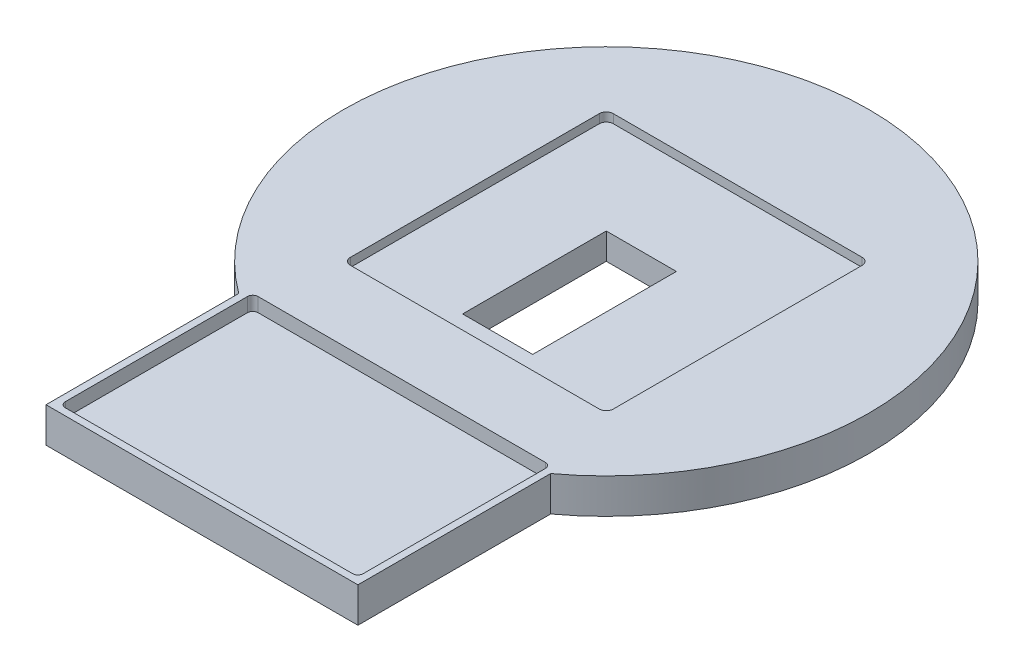
ISO-10303-21;
HEADER;
FILE_DESCRIPTION(('STEP AP214'),'2;1');
FILE_NAME('part.step','',(''),(''),'','','');
FILE_SCHEMA(('AUTOMOTIVE_DESIGN { 1 0 10303 214 1 1 1 1 }'));
ENDSEC;
DATA;
#1=APPLICATION_CONTEXT('core data for automotive mechanical design processes');
#2=APPLICATION_PROTOCOL_DEFINITION('international standard','automotive_design',2000,#1);
#3=PRODUCT_CONTEXT('',#1,'mechanical');
#4=PRODUCT('Part','Part','',(#3));
#5=PRODUCT_RELATED_PRODUCT_CATEGORY('part','',(#4));
#6=PRODUCT_DEFINITION_FORMATION('','',#4);
#7=PRODUCT_DEFINITION_CONTEXT('part definition',#1,'design');
#8=PRODUCT_DEFINITION('design','',#6,#7);
#9=PRODUCT_DEFINITION_SHAPE('','',#8);
#10=(LENGTH_UNIT() NAMED_UNIT(*) SI_UNIT(.MILLI.,.METRE.));
#11=(NAMED_UNIT(*) PLANE_ANGLE_UNIT() SI_UNIT($,.RADIAN.));
#12=(NAMED_UNIT(*) SI_UNIT($,.STERADIAN.) SOLID_ANGLE_UNIT());
#13=UNCERTAINTY_MEASURE_WITH_UNIT(LENGTH_MEASURE(1.E-05),#10,'distance_accuracy_value','');
#14=(GEOMETRIC_REPRESENTATION_CONTEXT(3) GLOBAL_UNCERTAINTY_ASSIGNED_CONTEXT((#13)) GLOBAL_UNIT_ASSIGNED_CONTEXT((#10,
#11,#12)) REPRESENTATION_CONTEXT('',''));
#15=CARTESIAN_POINT('',(0.,0.,0.));
#16=DIRECTION('',(0.,0.,1.));
#17=DIRECTION('',(1.,0.,0.));
#18=AXIS2_PLACEMENT_3D('',#15,#16,#17);
#19=CARTESIAN_POINT('',(0.,10.,0.));
#20=DIRECTION('',(0.,-1.,0.));
#21=DIRECTION('',(0.,0.,-1.));
#22=AXIS2_PLACEMENT_3D('',#19,#20,#21);
#23=CYLINDRICAL_SURFACE('',#22,75.);
#24=CARTESIAN_POINT('',(0.,0.,0.));
#25=DIRECTION('',(0.,1.,0.));
#26=DIRECTION('',(0.,0.,1.));
#27=AXIS2_PLACEMENT_3D('',#24,#25,#26);
#28=CIRCLE('',#27,75.);
#29=CARTESIAN_POINT('',(44.5,0.,60.3717649236794));
#30=VERTEX_POINT('',#29);
#31=CARTESIAN_POINT('',(-44.5,0.,60.3717649236794));
#32=VERTEX_POINT('',#31);
#33=EDGE_CURVE('E260',#30,#32,#28,.T.);
#34=ORIENTED_EDGE('',*,*,#33,.T.);
#35=DIRECTION('',(0.,-1.,0.));
#36=VECTOR('',#35,1.);
#37=CARTESIAN_POINT('',(-44.5,10.,60.3717649236794));
#38=LINE('',#37,#36);
#39=CARTESIAN_POINT('',(-44.5,10.,60.3717649236794));
#40=VERTEX_POINT('',#39);
#41=EDGE_CURVE('E297',#40,#32,#38,.T.);
#42=ORIENTED_EDGE('',*,*,#41,.F.);
#43=CARTESIAN_POINT('',(0.,10.,0.));
#44=DIRECTION('',(0.,1.,0.));
#45=DIRECTION('',(0.,0.,1.));
#46=AXIS2_PLACEMENT_3D('',#43,#44,#45);
#47=CIRCLE('',#46,75.);
#48=CARTESIAN_POINT('',(44.5,10.,60.3717649236794));
#49=VERTEX_POINT('',#48);
#50=EDGE_CURVE('E271',#49,#40,#47,.T.);
#51=ORIENTED_EDGE('',*,*,#50,.F.);
#52=DIRECTION('',(0.,-1.,0.));
#53=VECTOR('',#52,1.);
#54=CARTESIAN_POINT('',(44.5,10.,60.3717649236794));
#55=LINE('',#54,#53);
#56=EDGE_CURVE('E281',#49,#30,#55,.T.);
#57=ORIENTED_EDGE('',*,*,#56,.T.);
#58=EDGE_LOOP('',(#34,#42,#51,#57));
#59=FACE_BOUND('',#58,.T.);
#60=ADVANCED_FACE('F33',(#59),#23,.T.);
#61=CARTESIAN_POINT('',(-44.5,10.,60.3717649236794));
#62=DIRECTION('',(1.,0.,0.));
#63=DIRECTION('',(0.,0.,-1.));
#64=AXIS2_PLACEMENT_3D('',#61,#62,#63);
#65=PLANE('',#64);
#66=DIRECTION('',(0.,0.,1.));
#67=VECTOR('',#66,1.);
#68=CARTESIAN_POINT('',(-44.5,0.,60.3717649236794));
#69=LINE('',#68,#67);
#70=CARTESIAN_POINT('',(-44.5,0.,115.371764923679));
#71=VERTEX_POINT('',#70);
#72=EDGE_CURVE('E284',#32,#71,#69,.T.);
#73=ORIENTED_EDGE('',*,*,#72,.T.);
#74=DIRECTION('',(0.,-1.,0.));
#75=VECTOR('',#74,1.);
#76=CARTESIAN_POINT('',(-44.5,10.,115.371764923679));
#77=LINE('',#76,#75);
#78=CARTESIAN_POINT('',(-44.5,10.,115.371764923679));
#79=VERTEX_POINT('',#78);
#80=EDGE_CURVE('E294',#79,#71,#77,.T.);
#81=ORIENTED_EDGE('',*,*,#80,.F.);
#82=DIRECTION('',(0.,0.,1.));
#83=VECTOR('',#82,1.);
#84=CARTESIAN_POINT('',(-44.5,10.,60.3717649236794));
#85=LINE('',#84,#83);
#86=EDGE_CURVE('E274',#40,#79,#85,.T.);
#87=ORIENTED_EDGE('',*,*,#86,.F.);
#88=ORIENTED_EDGE('',*,*,#41,.T.);
#89=EDGE_LOOP('',(#73,#81,#87,#88));
#90=FACE_BOUND('',#89,.T.);
#91=ADVANCED_FACE('F391',(#90),#65,.F.);
#92=CARTESIAN_POINT('',(-44.5,10.,115.371764923679));
#93=DIRECTION('',(0.,0.,-1.));
#94=DIRECTION('',(-1.,0.,0.));
#95=AXIS2_PLACEMENT_3D('',#92,#93,#94);
#96=PLANE('',#95);
#97=DIRECTION('',(1.,0.,0.));
#98=VECTOR('',#97,1.);
#99=CARTESIAN_POINT('',(-44.5,0.,115.371764923679));
#100=LINE('',#99,#98);
#101=CARTESIAN_POINT('',(44.5,0.,115.371764923679));
#102=VERTEX_POINT('',#101);
#103=EDGE_CURVE('E286',#71,#102,#100,.T.);
#104=ORIENTED_EDGE('',*,*,#103,.T.);
#105=DIRECTION('',(0.,-1.,0.));
#106=VECTOR('',#105,1.);
#107=CARTESIAN_POINT('',(44.5,10.,115.371764923679));
#108=LINE('',#107,#106);
#109=CARTESIAN_POINT('',(44.5,10.,115.371764923679));
#110=VERTEX_POINT('',#109);
#111=EDGE_CURVE('E291',#110,#102,#108,.T.);
#112=ORIENTED_EDGE('',*,*,#111,.F.);
#113=DIRECTION('',(1.,0.,0.));
#114=VECTOR('',#113,1.);
#115=CARTESIAN_POINT('',(-44.5,10.,115.371764923679));
#116=LINE('',#115,#114);
#117=EDGE_CURVE('E277',#79,#110,#116,.T.);
#118=ORIENTED_EDGE('',*,*,#117,.F.);
#119=ORIENTED_EDGE('',*,*,#80,.T.);
#120=EDGE_LOOP('',(#104,#112,#118,#119));
#121=FACE_BOUND('',#120,.T.);
#122=ADVANCED_FACE('F397',(#121),#96,.F.);
#123=CARTESIAN_POINT('',(44.5,10.,115.371764923679));
#124=DIRECTION('',(-1.,0.,0.));
#125=DIRECTION('',(0.,0.,1.));
#126=AXIS2_PLACEMENT_3D('',#123,#124,#125);
#127=PLANE('',#126);
#128=DIRECTION('',(0.,0.,-1.));
#129=VECTOR('',#128,1.);
#130=CARTESIAN_POINT('',(44.5,0.,115.371764923679));
#131=LINE('',#130,#129);
#132=EDGE_CURVE('E275',#102,#30,#131,.T.);
#133=ORIENTED_EDGE('',*,*,#132,.T.);
#134=ORIENTED_EDGE('',*,*,#56,.F.);
#135=DIRECTION('',(0.,0.,-1.));
#136=VECTOR('',#135,1.);
#137=CARTESIAN_POINT('',(44.5,10.,115.371764923679));
#138=LINE('',#137,#136);
#139=EDGE_CURVE('E279',#110,#49,#138,.T.);
#140=ORIENTED_EDGE('',*,*,#139,.F.);
#141=ORIENTED_EDGE('',*,*,#111,.T.);
#142=EDGE_LOOP('',(#133,#134,#140,#141));
#143=FACE_BOUND('',#142,.T.);
#144=ADVANCED_FACE('F466',(#143),#127,.F.);
#145=CARTESIAN_POINT('',(0.,10.,0.));
#146=DIRECTION('',(0.,1.,0.));
#147=DIRECTION('',(0.,0.,1.));
#148=AXIS2_PLACEMENT_3D('',#145,#146,#147);
#149=PLANE('',#148);
#150=DIRECTION('',(1.,0.,0.));
#151=VECTOR('',#150,1.);
#152=CARTESIAN_POINT('',(42.5,10.,113.371764923679));
#153=LINE('',#152,#151);
#154=CARTESIAN_POINT('',(-41.,10.,113.371764923679));
#155=VERTEX_POINT('',#154);
#156=CARTESIAN_POINT('',(41.,10.,113.371764923679));
#157=VERTEX_POINT('',#156);
#158=EDGE_CURVE('E219',#155,#157,#153,.T.);
#159=ORIENTED_EDGE('',*,*,#158,.F.);
#160=CARTESIAN_POINT('',(-41.,10.,111.871764923679));
#161=DIRECTION('',(0.,1.,0.));
#162=DIRECTION('',(0.,0.,1.));
#163=AXIS2_PLACEMENT_3D('',#160,#161,#162);
#164=CIRCLE('',#163,1.5);
#165=CARTESIAN_POINT('',(-42.5,10.,111.871764923679));
#166=VERTEX_POINT('',#165);
#167=EDGE_CURVE('E364',#155,#166,#164,.F.);
#168=ORIENTED_EDGE('',*,*,#167,.T.);
#169=DIRECTION('',(0.,0.,1.));
#170=VECTOR('',#169,1.);
#171=CARTESIAN_POINT('',(-42.5,10.,113.371764923679));
#172=LINE('',#171,#170);
#173=CARTESIAN_POINT('',(-42.5,10.,59.8717649236793));
#174=VERTEX_POINT('',#173);
#175=EDGE_CURVE('E227',#174,#166,#172,.T.);
#176=ORIENTED_EDGE('',*,*,#175,.F.);
#177=CARTESIAN_POINT('',(-41.,10.,59.8717649236793));
#178=DIRECTION('',(0.,1.,0.));
#179=DIRECTION('',(0.,0.,1.));
#180=AXIS2_PLACEMENT_3D('',#177,#178,#179);
#181=CIRCLE('',#180,1.5);
#182=CARTESIAN_POINT('',(-41.,10.,58.3717649236793));
#183=VERTEX_POINT('',#182);
#184=EDGE_CURVE('E370',#174,#183,#181,.F.);
#185=ORIENTED_EDGE('',*,*,#184,.T.);
#186=DIRECTION('',(-1.,0.,0.));
#187=VECTOR('',#186,1.);
#188=CARTESIAN_POINT('',(-42.5,10.,58.3717649236793));
#189=LINE('',#188,#187);
#190=CARTESIAN_POINT('',(41.,10.,58.3717649236793));
#191=VERTEX_POINT('',#190);
#192=EDGE_CURVE('E242',#191,#183,#189,.T.);
#193=ORIENTED_EDGE('',*,*,#192,.F.);
#194=CARTESIAN_POINT('',(41.,10.,59.8717649236793));
#195=DIRECTION('',(0.,1.,0.));
#196=DIRECTION('',(0.,0.,1.));
#197=AXIS2_PLACEMENT_3D('',#194,#195,#196);
#198=CIRCLE('',#197,1.5);
#199=CARTESIAN_POINT('',(42.5,10.,59.8717649236793));
#200=VERTEX_POINT('',#199);
#201=EDGE_CURVE('E368',#191,#200,#198,.F.);
#202=ORIENTED_EDGE('',*,*,#201,.T.);
#203=DIRECTION('',(0.,0.,-1.));
#204=VECTOR('',#203,1.);
#205=CARTESIAN_POINT('',(42.5,10.,58.3717649236793));
#206=LINE('',#205,#204);
#207=CARTESIAN_POINT('',(42.5,10.,111.871764923679));
#208=VERTEX_POINT('',#207);
#209=EDGE_CURVE('E239',#208,#200,#206,.T.);
#210=ORIENTED_EDGE('',*,*,#209,.F.);
#211=CARTESIAN_POINT('',(41.,10.,111.871764923679));
#212=DIRECTION('',(0.,1.,0.));
#213=DIRECTION('',(0.,0.,1.));
#214=AXIS2_PLACEMENT_3D('',#211,#212,#213);
#215=CIRCLE('',#214,1.5);
#216=EDGE_CURVE('E366',#208,#157,#215,.F.);
#217=ORIENTED_EDGE('',*,*,#216,.T.);
#218=EDGE_LOOP('',(#159,#168,#176,#185,#193,#202,#210,#217));
#219=FACE_BOUND('',#218,.T.);
#220=DIRECTION('',(0.,0.,-1.));
#221=VECTOR('',#220,1.);
#222=CARTESIAN_POINT('',(37.5,10.,-37.5));
#223=LINE('',#222,#221);
#224=CARTESIAN_POINT('',(37.5,10.,35.5));
#225=VERTEX_POINT('',#224);
#226=CARTESIAN_POINT('',(37.5,10.,-35.5));
#227=VERTEX_POINT('',#226);
#228=EDGE_CURVE('E236',#225,#227,#223,.T.);
#229=ORIENTED_EDGE('',*,*,#228,.F.);
#230=CARTESIAN_POINT('',(35.5,10.,35.5));
#231=DIRECTION('',(0.,1.,0.));
#232=DIRECTION('',(0.,0.,1.));
#233=AXIS2_PLACEMENT_3D('',#230,#231,#232);
#234=CIRCLE('',#233,2.);
#235=CARTESIAN_POINT('',(35.5,10.,37.5));
#236=VERTEX_POINT('',#235);
#237=EDGE_CURVE('E328',#225,#236,#234,.F.);
#238=ORIENTED_EDGE('',*,*,#237,.T.);
#239=DIRECTION('',(1.,0.,0.));
#240=VECTOR('',#239,1.);
#241=CARTESIAN_POINT('',(-37.5,10.,37.5));
#242=LINE('',#241,#240);
#243=CARTESIAN_POINT('',(-35.5,10.,37.5));
#244=VERTEX_POINT('',#243);
#245=EDGE_CURVE('E251',#244,#236,#242,.T.);
#246=ORIENTED_EDGE('',*,*,#245,.F.);
#247=CARTESIAN_POINT('',(-35.5,10.,35.5));
#248=DIRECTION('',(0.,1.,0.));
#249=DIRECTION('',(0.,0.,1.));
#250=AXIS2_PLACEMENT_3D('',#247,#248,#249);
#251=CIRCLE('',#250,2.);
#252=CARTESIAN_POINT('',(-37.5,10.,35.5));
#253=VERTEX_POINT('',#252);
#254=EDGE_CURVE('E330',#244,#253,#251,.F.);
#255=ORIENTED_EDGE('',*,*,#254,.T.);
#256=DIRECTION('',(0.,0.,1.));
#257=VECTOR('',#256,1.);
#258=CARTESIAN_POINT('',(-37.5,10.,-37.5));
#259=LINE('',#258,#257);
#260=CARTESIAN_POINT('',(-37.5,10.,-35.5));
#261=VERTEX_POINT('',#260);
#262=EDGE_CURVE('E266',#261,#253,#259,.T.);
#263=ORIENTED_EDGE('',*,*,#262,.F.);
#264=CARTESIAN_POINT('',(-35.5,10.,-35.5));
#265=DIRECTION('',(0.,1.,0.));
#266=DIRECTION('',(0.,0.,1.));
#267=AXIS2_PLACEMENT_3D('',#264,#265,#266);
#268=CIRCLE('',#267,2.);
#269=CARTESIAN_POINT('',(-35.5,10.,-37.5));
#270=VERTEX_POINT('',#269);
#271=EDGE_CURVE('E332',#261,#270,#268,.F.);
#272=ORIENTED_EDGE('',*,*,#271,.T.);
#273=DIRECTION('',(-1.,0.,0.));
#274=VECTOR('',#273,1.);
#275=CARTESIAN_POINT('',(-37.5,10.,-37.5));
#276=LINE('',#275,#274);
#277=CARTESIAN_POINT('',(35.5,10.,-37.5));
#278=VERTEX_POINT('',#277);
#279=EDGE_CURVE('E263',#278,#270,#276,.T.);
#280=ORIENTED_EDGE('',*,*,#279,.F.);
#281=CARTESIAN_POINT('',(35.5,10.,-35.5));
#282=DIRECTION('',(0.,1.,0.));
#283=DIRECTION('',(0.,0.,1.));
#284=AXIS2_PLACEMENT_3D('',#281,#282,#283);
#285=CIRCLE('',#284,2.);
#286=EDGE_CURVE('E334',#278,#227,#285,.F.);
#287=ORIENTED_EDGE('',*,*,#286,.T.);
#288=EDGE_LOOP('',(#229,#238,#246,#255,#263,#272,#280,#287));
#289=FACE_BOUND('',#288,.T.);
#290=ORIENTED_EDGE('',*,*,#50,.T.);
#291=ORIENTED_EDGE('',*,*,#86,.T.);
#292=ORIENTED_EDGE('',*,*,#117,.T.);
#293=ORIENTED_EDGE('',*,*,#139,.T.);
#294=EDGE_LOOP('',(#290,#291,#292,#293));
#295=FACE_BOUND('',#294,.T.);
#296=ADVANCED_FACE('F463',(#219,#289,#295),#149,.T.);
#297=CARTESIAN_POINT('',(0.,0.,0.));
#298=DIRECTION('',(0.,1.,0.));
#299=DIRECTION('',(0.,0.,1.));
#300=AXIS2_PLACEMENT_3D('',#297,#298,#299);
#301=PLANE('',#300);
#302=DIRECTION('',(1.,0.,0.));
#303=VECTOR('',#302,1.);
#304=CARTESIAN_POINT('',(0.,0.,31.));
#305=LINE('',#304,#303);
#306=CARTESIAN_POINT('',(-10.,0.,31.));
#307=VERTEX_POINT('',#306);
#308=CARTESIAN_POINT('',(10.,0.,31.));
#309=VERTEX_POINT('',#308);
#310=EDGE_CURVE('E41',#307,#309,#305,.T.);
#311=ORIENTED_EDGE('',*,*,#310,.T.);
#312=DIRECTION('',(0.,0.,-1.));
#313=VECTOR('',#312,1.);
#314=CARTESIAN_POINT('',(10.,0.,0.));
#315=LINE('',#314,#313);
#316=CARTESIAN_POINT('',(10.,0.,-10.));
#317=VERTEX_POINT('',#316);
#318=EDGE_CURVE('E11',#309,#317,#315,.T.);
#319=ORIENTED_EDGE('',*,*,#318,.T.);
#320=DIRECTION('',(-1.,0.,0.));
#321=VECTOR('',#320,1.);
#322=CARTESIAN_POINT('',(0.,0.,-10.));
#323=LINE('',#322,#321);
#324=CARTESIAN_POINT('',(-10.,0.,-10.));
#325=VERTEX_POINT('',#324);
#326=EDGE_CURVE('E199',#317,#325,#323,.T.);
#327=ORIENTED_EDGE('',*,*,#326,.T.);
#328=DIRECTION('',(0.,0.,1.));
#329=VECTOR('',#328,1.);
#330=CARTESIAN_POINT('',(-10.,0.,0.));
#331=LINE('',#330,#329);
#332=EDGE_CURVE('E373',#325,#307,#331,.T.);
#333=ORIENTED_EDGE('',*,*,#332,.T.);
#334=EDGE_LOOP('',(#311,#319,#327,#333));
#335=FACE_BOUND('',#334,.T.);
#336=ORIENTED_EDGE('',*,*,#33,.F.);
#337=ORIENTED_EDGE('',*,*,#132,.F.);
#338=ORIENTED_EDGE('',*,*,#103,.F.);
#339=ORIENTED_EDGE('',*,*,#72,.F.);
#340=EDGE_LOOP('',(#336,#337,#338,#339));
#341=FACE_BOUND('',#340,.T.);
#342=ADVANCED_FACE('F377',(#335,#341),#301,.F.);
#343=CARTESIAN_POINT('',(37.5,7.5,-37.5));
#344=DIRECTION('',(1.,0.,0.));
#345=DIRECTION('',(0.,0.,-1.));
#346=AXIS2_PLACEMENT_3D('',#343,#344,#345);
#347=PLANE('',#346);
#348=DIRECTION('',(0.,0.,-1.));
#349=VECTOR('',#348,1.);
#350=CARTESIAN_POINT('',(37.5,7.5,-37.5));
#351=LINE('',#350,#349);
#352=CARTESIAN_POINT('',(37.5,7.5,35.5));
#353=VERTEX_POINT('',#352);
#354=CARTESIAN_POINT('',(37.5,7.5,-35.5));
#355=VERTEX_POINT('',#354);
#356=EDGE_CURVE('E247',#353,#355,#351,.T.);
#357=ORIENTED_EDGE('',*,*,#356,.F.);
#358=DIRECTION('',(0.,1.,0.));
#359=VECTOR('',#358,1.);
#360=CARTESIAN_POINT('',(37.5,10.,35.5));
#361=LINE('',#360,#359);
#362=EDGE_CURVE('E302',#353,#225,#361,.T.);
#363=ORIENTED_EDGE('',*,*,#362,.T.);
#364=ORIENTED_EDGE('',*,*,#228,.T.);
#365=DIRECTION('',(0.,1.,0.));
#366=VECTOR('',#365,1.);
#367=CARTESIAN_POINT('',(37.5,7.5,-35.5));
#368=LINE('',#367,#366);
#369=EDGE_CURVE('E300',#227,#355,#368,.F.);
#370=ORIENTED_EDGE('',*,*,#369,.T.);
#371=EDGE_LOOP('',(#357,#363,#364,#370));
#372=FACE_BOUND('',#371,.T.);
#373=ADVANCED_FACE('F483',(#372),#347,.F.);
#374=CARTESIAN_POINT('',(-37.5,7.5,37.5));
#375=DIRECTION('',(0.,0.,1.));
#376=DIRECTION('',(1.,0.,0.));
#377=AXIS2_PLACEMENT_3D('',#374,#375,#376);
#378=PLANE('',#377);
#379=ORIENTED_EDGE('',*,*,#245,.T.);
#380=DIRECTION('',(0.,1.,0.));
#381=VECTOR('',#380,1.);
#382=CARTESIAN_POINT('',(35.5,7.5,37.5));
#383=LINE('',#382,#381);
#384=CARTESIAN_POINT('',(35.5,7.5,37.5));
#385=VERTEX_POINT('',#384);
#386=EDGE_CURVE('E308',#236,#385,#383,.F.);
#387=ORIENTED_EDGE('',*,*,#386,.T.);
#388=DIRECTION('',(1.,0.,0.));
#389=VECTOR('',#388,1.);
#390=CARTESIAN_POINT('',(-37.5,7.5,37.5));
#391=LINE('',#390,#389);
#392=CARTESIAN_POINT('',(-35.5,7.5,37.5));
#393=VERTEX_POINT('',#392);
#394=EDGE_CURVE('E257',#393,#385,#391,.T.);
#395=ORIENTED_EDGE('',*,*,#394,.F.);
#396=DIRECTION('',(0.,1.,0.));
#397=VECTOR('',#396,1.);
#398=CARTESIAN_POINT('',(-35.5,10.,37.5));
#399=LINE('',#398,#397);
#400=EDGE_CURVE('E305',#393,#244,#399,.T.);
#401=ORIENTED_EDGE('',*,*,#400,.T.);
#402=EDGE_LOOP('',(#379,#387,#395,#401));
#403=FACE_BOUND('',#402,.T.);
#404=ADVANCED_FACE('F488',(#403),#378,.F.);
#405=CARTESIAN_POINT('',(-37.5,7.5,-37.5));
#406=DIRECTION('',(-1.,0.,0.));
#407=DIRECTION('',(0.,0.,1.));
#408=AXIS2_PLACEMENT_3D('',#405,#406,#407);
#409=PLANE('',#408);
#410=ORIENTED_EDGE('',*,*,#262,.T.);
#411=DIRECTION('',(0.,1.,0.));
#412=VECTOR('',#411,1.);
#413=CARTESIAN_POINT('',(-37.5,7.5,35.5));
#414=LINE('',#413,#412);
#415=CARTESIAN_POINT('',(-37.5,7.5,35.5));
#416=VERTEX_POINT('',#415);
#417=EDGE_CURVE('E321',#253,#416,#414,.F.);
#418=ORIENTED_EDGE('',*,*,#417,.T.);
#419=DIRECTION('',(0.,0.,1.));
#420=VECTOR('',#419,1.);
#421=CARTESIAN_POINT('',(-37.5,7.5,-37.5));
#422=LINE('',#421,#420);
#423=CARTESIAN_POINT('',(-37.5,7.5,-35.5));
#424=VERTEX_POINT('',#423);
#425=EDGE_CURVE('E254',#424,#416,#422,.T.);
#426=ORIENTED_EDGE('',*,*,#425,.F.);
#427=DIRECTION('',(0.,1.,0.));
#428=VECTOR('',#427,1.);
#429=CARTESIAN_POINT('',(-37.5,10.,-35.5));
#430=LINE('',#429,#428);
#431=EDGE_CURVE('E318',#424,#261,#430,.T.);
#432=ORIENTED_EDGE('',*,*,#431,.T.);
#433=EDGE_LOOP('',(#410,#418,#426,#432));
#434=FACE_BOUND('',#433,.T.);
#435=ADVANCED_FACE('F621',(#434),#409,.F.);
#436=CARTESIAN_POINT('',(-37.5,7.5,-37.5));
#437=DIRECTION('',(0.,0.,-1.));
#438=DIRECTION('',(-1.,0.,0.));
#439=AXIS2_PLACEMENT_3D('',#436,#437,#438);
#440=PLANE('',#439);
#441=ORIENTED_EDGE('',*,*,#279,.T.);
#442=DIRECTION('',(0.,1.,0.));
#443=VECTOR('',#442,1.);
#444=CARTESIAN_POINT('',(-35.5,7.5,-37.5));
#445=LINE('',#444,#443);
#446=CARTESIAN_POINT('',(-35.5,7.5,-37.5));
#447=VERTEX_POINT('',#446);
#448=EDGE_CURVE('E326',#270,#447,#445,.F.);
#449=ORIENTED_EDGE('',*,*,#448,.T.);
#450=DIRECTION('',(-1.,0.,0.));
#451=VECTOR('',#450,1.);
#452=CARTESIAN_POINT('',(-37.5,7.5,-37.5));
#453=LINE('',#452,#451);
#454=CARTESIAN_POINT('',(35.5,7.5,-37.5));
#455=VERTEX_POINT('',#454);
#456=EDGE_CURVE('E250',#455,#447,#453,.T.);
#457=ORIENTED_EDGE('',*,*,#456,.F.);
#458=DIRECTION('',(0.,1.,0.));
#459=VECTOR('',#458,1.);
#460=CARTESIAN_POINT('',(35.5,10.,-37.5));
#461=LINE('',#460,#459);
#462=EDGE_CURVE('E323',#455,#278,#461,.T.);
#463=ORIENTED_EDGE('',*,*,#462,.T.);
#464=EDGE_LOOP('',(#441,#449,#457,#463));
#465=FACE_BOUND('',#464,.T.);
#466=ADVANCED_FACE('F589',(#465),#440,.F.);
#467=CARTESIAN_POINT('',(0.,7.5,0.));
#468=DIRECTION('',(0.,1.,0.));
#469=DIRECTION('',(0.,0.,1.));
#470=AXIS2_PLACEMENT_3D('',#467,#468,#469);
#471=PLANE('',#470);
#472=DIRECTION('',(0.,0.,-1.));
#473=VECTOR('',#472,1.);
#474=CARTESIAN_POINT('',(10.,7.5,-10.));
#475=LINE('',#474,#473);
#476=CARTESIAN_POINT('',(10.,7.5,31.));
#477=VERTEX_POINT('',#476);
#478=CARTESIAN_POINT('',(10.,7.5,-10.));
#479=VERTEX_POINT('',#478);
#480=EDGE_CURVE('E204',#477,#479,#475,.T.);
#481=ORIENTED_EDGE('',*,*,#480,.F.);
#482=DIRECTION('',(1.,0.,0.));
#483=VECTOR('',#482,1.);
#484=CARTESIAN_POINT('',(-10.,7.5,31.));
#485=LINE('',#484,#483);
#486=CARTESIAN_POINT('',(-10.,7.5,31.));
#487=VERTEX_POINT('',#486);
#488=EDGE_CURVE('E201',#487,#477,#485,.T.);
#489=ORIENTED_EDGE('',*,*,#488,.F.);
#490=DIRECTION('',(0.,0.,1.));
#491=VECTOR('',#490,1.);
#492=CARTESIAN_POINT('',(-10.,7.5,-10.));
#493=LINE('',#492,#491);
#494=CARTESIAN_POINT('',(-10.,7.5,-10.));
#495=VERTEX_POINT('',#494);
#496=EDGE_CURVE('E48',#495,#487,#493,.T.);
#497=ORIENTED_EDGE('',*,*,#496,.F.);
#498=DIRECTION('',(-1.,0.,0.));
#499=VECTOR('',#498,1.);
#500=CARTESIAN_POINT('',(-10.,7.5,-10.));
#501=LINE('',#500,#499);
#502=EDGE_CURVE('E197',#479,#495,#501,.T.);
#503=ORIENTED_EDGE('',*,*,#502,.F.);
#504=EDGE_LOOP('',(#481,#489,#497,#503));
#505=FACE_BOUND('',#504,.T.);
#506=ORIENTED_EDGE('',*,*,#394,.T.);
#507=CARTESIAN_POINT('',(35.5,7.5,35.5));
#508=DIRECTION('',(0.,1.,0.));
#509=DIRECTION('',(0.,0.,1.));
#510=AXIS2_PLACEMENT_3D('',#507,#508,#509);
#511=CIRCLE('',#510,2.);
#512=EDGE_CURVE('E316',#385,#353,#511,.T.);
#513=ORIENTED_EDGE('',*,*,#512,.T.);
#514=ORIENTED_EDGE('',*,*,#356,.T.);
#515=CARTESIAN_POINT('',(35.5,7.5,-35.5));
#516=DIRECTION('',(0.,1.,0.));
#517=DIRECTION('',(0.,0.,1.));
#518=AXIS2_PLACEMENT_3D('',#515,#516,#517);
#519=CIRCLE('',#518,2.);
#520=EDGE_CURVE('E310',#355,#455,#519,.T.);
#521=ORIENTED_EDGE('',*,*,#520,.T.);
#522=ORIENTED_EDGE('',*,*,#456,.T.);
#523=CARTESIAN_POINT('',(-35.5,7.5,-35.5));
#524=DIRECTION('',(0.,1.,0.));
#525=DIRECTION('',(0.,0.,1.));
#526=AXIS2_PLACEMENT_3D('',#523,#524,#525);
#527=CIRCLE('',#526,2.);
#528=EDGE_CURVE('E312',#447,#424,#527,.T.);
#529=ORIENTED_EDGE('',*,*,#528,.T.);
#530=ORIENTED_EDGE('',*,*,#425,.T.);
#531=CARTESIAN_POINT('',(-35.5,7.5,35.5));
#532=DIRECTION('',(0.,1.,0.));
#533=DIRECTION('',(0.,0.,1.));
#534=AXIS2_PLACEMENT_3D('',#531,#532,#533);
#535=CIRCLE('',#534,2.);
#536=EDGE_CURVE('E314',#416,#393,#535,.T.);
#537=ORIENTED_EDGE('',*,*,#536,.T.);
#538=EDGE_LOOP('',(#506,#513,#514,#521,#522,#529,#530,#537));
#539=FACE_BOUND('',#538,.T.);
#540=ADVANCED_FACE('F212',(#505,#539),#471,.T.);
#541=CARTESIAN_POINT('',(35.5,7.5,35.5));
#542=DIRECTION('',(0.,-1.,0.));
#543=DIRECTION('',(0.,0.,-1.));
#544=AXIS2_PLACEMENT_3D('',#541,#542,#543);
#545=CYLINDRICAL_SURFACE('',#544,2.);
#546=ORIENTED_EDGE('',*,*,#512,.F.);
#547=ORIENTED_EDGE('',*,*,#386,.F.);
#548=ORIENTED_EDGE('',*,*,#237,.F.);
#549=ORIENTED_EDGE('',*,*,#362,.F.);
#550=EDGE_LOOP('',(#546,#547,#548,#549));
#551=FACE_BOUND('',#550,.T.);
#552=ADVANCED_FACE('F402',(#551),#545,.F.);
#553=CARTESIAN_POINT('',(-35.5,7.5,35.5));
#554=DIRECTION('',(0.,-1.,0.));
#555=DIRECTION('',(0.,0.,-1.));
#556=AXIS2_PLACEMENT_3D('',#553,#554,#555);
#557=CYLINDRICAL_SURFACE('',#556,2.);
#558=ORIENTED_EDGE('',*,*,#536,.F.);
#559=ORIENTED_EDGE('',*,*,#417,.F.);
#560=ORIENTED_EDGE('',*,*,#254,.F.);
#561=ORIENTED_EDGE('',*,*,#400,.F.);
#562=EDGE_LOOP('',(#558,#559,#560,#561));
#563=FACE_BOUND('',#562,.T.);
#564=ADVANCED_FACE('F405',(#563),#557,.F.);
#565=CARTESIAN_POINT('',(-35.5,7.5,-35.5));
#566=DIRECTION('',(0.,-1.,0.));
#567=DIRECTION('',(0.,0.,-1.));
#568=AXIS2_PLACEMENT_3D('',#565,#566,#567);
#569=CYLINDRICAL_SURFACE('',#568,2.);
#570=ORIENTED_EDGE('',*,*,#528,.F.);
#571=ORIENTED_EDGE('',*,*,#448,.F.);
#572=ORIENTED_EDGE('',*,*,#271,.F.);
#573=ORIENTED_EDGE('',*,*,#431,.F.);
#574=EDGE_LOOP('',(#570,#571,#572,#573));
#575=FACE_BOUND('',#574,.T.);
#576=ADVANCED_FACE('F409',(#575),#569,.F.);
#577=CARTESIAN_POINT('',(35.5,7.5,-35.5));
#578=DIRECTION('',(0.,-1.,0.));
#579=DIRECTION('',(0.,0.,-1.));
#580=AXIS2_PLACEMENT_3D('',#577,#578,#579);
#581=CYLINDRICAL_SURFACE('',#580,2.);
#582=ORIENTED_EDGE('',*,*,#520,.F.);
#583=ORIENTED_EDGE('',*,*,#369,.F.);
#584=ORIENTED_EDGE('',*,*,#286,.F.);
#585=ORIENTED_EDGE('',*,*,#462,.F.);
#586=EDGE_LOOP('',(#582,#583,#584,#585));
#587=FACE_BOUND('',#586,.T.);
#588=ADVANCED_FACE('F413',(#587),#581,.F.);
#589=CARTESIAN_POINT('',(42.5,6.,113.371764923679));
#590=DIRECTION('',(0.,0.,1.));
#591=DIRECTION('',(1.,0.,0.));
#592=AXIS2_PLACEMENT_3D('',#589,#590,#591);
#593=PLANE('',#592);
#594=DIRECTION('',(1.,0.,0.));
#595=VECTOR('',#594,1.);
#596=CARTESIAN_POINT('',(42.5,6.,113.371764923679));
#597=LINE('',#596,#595);
#598=CARTESIAN_POINT('',(-41.,6.,113.371764923679));
#599=VERTEX_POINT('',#598);
#600=CARTESIAN_POINT('',(41.,6.,113.371764923679));
#601=VERTEX_POINT('',#600);
#602=EDGE_CURVE('E223',#599,#601,#597,.T.);
#603=ORIENTED_EDGE('',*,*,#602,.F.);
#604=DIRECTION('',(0.,1.,0.));
#605=VECTOR('',#604,1.);
#606=CARTESIAN_POINT('',(-41.,10.,113.371764923679));
#607=LINE('',#606,#605);
#608=EDGE_CURVE('E338',#599,#155,#607,.T.);
#609=ORIENTED_EDGE('',*,*,#608,.T.);
#610=ORIENTED_EDGE('',*,*,#158,.T.);
#611=DIRECTION('',(0.,1.,0.));
#612=VECTOR('',#611,1.);
#613=CARTESIAN_POINT('',(41.,6.,113.371764923679));
#614=LINE('',#613,#612);
#615=EDGE_CURVE('E336',#157,#601,#614,.F.);
#616=ORIENTED_EDGE('',*,*,#615,.T.);
#617=EDGE_LOOP('',(#603,#609,#610,#616));
#618=FACE_BOUND('',#617,.T.);
#619=ADVANCED_FACE('F417',(#618),#593,.F.);
#620=CARTESIAN_POINT('',(-42.5,6.,113.371764923679));
#621=DIRECTION('',(-1.,0.,0.));
#622=DIRECTION('',(0.,0.,1.));
#623=AXIS2_PLACEMENT_3D('',#620,#621,#622);
#624=PLANE('',#623);
#625=ORIENTED_EDGE('',*,*,#175,.T.);
#626=DIRECTION('',(0.,1.,0.));
#627=VECTOR('',#626,1.);
#628=CARTESIAN_POINT('',(-42.5,6.,111.871764923679));
#629=LINE('',#628,#627);
#630=CARTESIAN_POINT('',(-42.5,6.,111.871764923679));
#631=VERTEX_POINT('',#630);
#632=EDGE_CURVE('E344',#166,#631,#629,.F.);
#633=ORIENTED_EDGE('',*,*,#632,.T.);
#634=DIRECTION('',(0.,0.,1.));
#635=VECTOR('',#634,1.);
#636=CARTESIAN_POINT('',(-42.5,6.,113.371764923679));
#637=LINE('',#636,#635);
#638=CARTESIAN_POINT('',(-42.5,6.,59.8717649236793));
#639=VERTEX_POINT('',#638);
#640=EDGE_CURVE('E233',#639,#631,#637,.T.);
#641=ORIENTED_EDGE('',*,*,#640,.F.);
#642=DIRECTION('',(0.,1.,0.));
#643=VECTOR('',#642,1.);
#644=CARTESIAN_POINT('',(-42.5,10.,59.8717649236793));
#645=LINE('',#644,#643);
#646=EDGE_CURVE('E341',#639,#174,#645,.T.);
#647=ORIENTED_EDGE('',*,*,#646,.T.);
#648=EDGE_LOOP('',(#625,#633,#641,#647));
#649=FACE_BOUND('',#648,.T.);
#650=ADVANCED_FACE('F449',(#649),#624,.F.);
#651=CARTESIAN_POINT('',(-42.5,6.,58.3717649236793));
#652=DIRECTION('',(0.,0.,-1.));
#653=DIRECTION('',(-1.,0.,0.));
#654=AXIS2_PLACEMENT_3D('',#651,#652,#653);
#655=PLANE('',#654);
#656=DIRECTION('',(-1.,0.,0.));
#657=VECTOR('',#656,1.);
#658=CARTESIAN_POINT('',(-42.5,6.,58.3717649236793));
#659=LINE('',#658,#657);
#660=CARTESIAN_POINT('',(41.,6.,58.3717649236793));
#661=VERTEX_POINT('',#660);
#662=CARTESIAN_POINT('',(-41.,6.,58.3717649236793));
#663=VERTEX_POINT('',#662);
#664=EDGE_CURVE('E230',#661,#663,#659,.T.);
#665=ORIENTED_EDGE('',*,*,#664,.F.);
#666=DIRECTION('',(0.,1.,0.));
#667=VECTOR('',#666,1.);
#668=CARTESIAN_POINT('',(41.,10.,58.3717649236793));
#669=LINE('',#668,#667);
#670=EDGE_CURVE('E361',#661,#191,#669,.T.);
#671=ORIENTED_EDGE('',*,*,#670,.T.);
#672=ORIENTED_EDGE('',*,*,#192,.T.);
#673=DIRECTION('',(0.,1.,0.));
#674=VECTOR('',#673,1.);
#675=CARTESIAN_POINT('',(-41.,6.,58.3717649236793));
#676=LINE('',#675,#674);
#677=EDGE_CURVE('E359',#183,#663,#676,.F.);
#678=ORIENTED_EDGE('',*,*,#677,.T.);
#679=EDGE_LOOP('',(#665,#671,#672,#678));
#680=FACE_BOUND('',#679,.T.);
#681=ADVANCED_FACE('F442',(#680),#655,.F.);
#682=CARTESIAN_POINT('',(42.5,6.,58.3717649236793));
#683=DIRECTION('',(1.,0.,0.));
#684=DIRECTION('',(0.,0.,-1.));
#685=AXIS2_PLACEMENT_3D('',#682,#683,#684);
#686=PLANE('',#685);
#687=DIRECTION('',(0.,0.,-1.));
#688=VECTOR('',#687,1.);
#689=CARTESIAN_POINT('',(42.5,6.,58.3717649236793));
#690=LINE('',#689,#688);
#691=CARTESIAN_POINT('',(42.5,6.,111.871764923679));
#692=VERTEX_POINT('',#691);
#693=CARTESIAN_POINT('',(42.5,6.,59.8717649236793));
#694=VERTEX_POINT('',#693);
#695=EDGE_CURVE('E226',#692,#694,#690,.T.);
#696=ORIENTED_EDGE('',*,*,#695,.F.);
#697=DIRECTION('',(0.,1.,0.));
#698=VECTOR('',#697,1.);
#699=CARTESIAN_POINT('',(42.5,10.,111.871764923679));
#700=LINE('',#699,#698);
#701=EDGE_CURVE('E356',#692,#208,#700,.T.);
#702=ORIENTED_EDGE('',*,*,#701,.T.);
#703=ORIENTED_EDGE('',*,*,#209,.T.);
#704=DIRECTION('',(0.,1.,0.));
#705=VECTOR('',#704,1.);
#706=CARTESIAN_POINT('',(42.5,6.,59.8717649236793));
#707=LINE('',#706,#705);
#708=EDGE_CURVE('E354',#200,#694,#707,.F.);
#709=ORIENTED_EDGE('',*,*,#708,.T.);
#710=EDGE_LOOP('',(#696,#702,#703,#709));
#711=FACE_BOUND('',#710,.T.);
#712=ADVANCED_FACE('F460',(#711),#686,.F.);
#713=CARTESIAN_POINT('',(0.,6.,0.));
#714=DIRECTION('',(0.,-1.,0.));
#715=DIRECTION('',(0.,0.,-1.));
#716=AXIS2_PLACEMENT_3D('',#713,#714,#715);
#717=PLANE('',#716);
#718=ORIENTED_EDGE('',*,*,#640,.T.);
#719=CARTESIAN_POINT('',(-41.,6.,111.871764923679));
#720=DIRECTION('',(0.,-1.,0.));
#721=DIRECTION('',(0.,0.,-1.));
#722=AXIS2_PLACEMENT_3D('',#719,#720,#721);
#723=CIRCLE('',#722,1.5);
#724=EDGE_CURVE('E352',#631,#599,#723,.F.);
#725=ORIENTED_EDGE('',*,*,#724,.T.);
#726=ORIENTED_EDGE('',*,*,#602,.T.);
#727=CARTESIAN_POINT('',(41.,6.,111.871764923679));
#728=DIRECTION('',(0.,-1.,0.));
#729=DIRECTION('',(0.,0.,-1.));
#730=AXIS2_PLACEMENT_3D('',#727,#728,#729);
#731=CIRCLE('',#730,1.5);
#732=EDGE_CURVE('E350',#601,#692,#731,.F.);
#733=ORIENTED_EDGE('',*,*,#732,.T.);
#734=ORIENTED_EDGE('',*,*,#695,.T.);
#735=CARTESIAN_POINT('',(41.,6.,59.8717649236793));
#736=DIRECTION('',(0.,-1.,0.));
#737=DIRECTION('',(0.,0.,-1.));
#738=AXIS2_PLACEMENT_3D('',#735,#736,#737);
#739=CIRCLE('',#738,1.5);
#740=EDGE_CURVE('E348',#694,#661,#739,.F.);
#741=ORIENTED_EDGE('',*,*,#740,.T.);
#742=ORIENTED_EDGE('',*,*,#664,.T.);
#743=CARTESIAN_POINT('',(-41.,6.,59.8717649236793));
#744=DIRECTION('',(0.,-1.,0.));
#745=DIRECTION('',(0.,0.,-1.));
#746=AXIS2_PLACEMENT_3D('',#743,#744,#745);
#747=CIRCLE('',#746,1.5);
#748=EDGE_CURVE('E346',#663,#639,#747,.F.);
#749=ORIENTED_EDGE('',*,*,#748,.T.);
#750=EDGE_LOOP('',(#718,#725,#726,#733,#734,#741,#742,#749));
#751=FACE_BOUND('',#750,.T.);
#752=ADVANCED_FACE('F423',(#751),#717,.F.);
#753=CARTESIAN_POINT('',(-41.,6.,111.871764923679));
#754=DIRECTION('',(0.,-1.,0.));
#755=DIRECTION('',(0.,0.,-1.));
#756=AXIS2_PLACEMENT_3D('',#753,#754,#755);
#757=CYLINDRICAL_SURFACE('',#756,1.5);
#758=ORIENTED_EDGE('',*,*,#724,.F.);
#759=ORIENTED_EDGE('',*,*,#632,.F.);
#760=ORIENTED_EDGE('',*,*,#167,.F.);
#761=ORIENTED_EDGE('',*,*,#608,.F.);
#762=EDGE_LOOP('',(#758,#759,#760,#761));
#763=FACE_BOUND('',#762,.T.);
#764=ADVANCED_FACE('F419',(#763),#757,.F.);
#765=CARTESIAN_POINT('',(41.,6.,111.871764923679));
#766=DIRECTION('',(0.,-1.,0.));
#767=DIRECTION('',(0.,0.,-1.));
#768=AXIS2_PLACEMENT_3D('',#765,#766,#767);
#769=CYLINDRICAL_SURFACE('',#768,1.5);
#770=ORIENTED_EDGE('',*,*,#732,.F.);
#771=ORIENTED_EDGE('',*,*,#615,.F.);
#772=ORIENTED_EDGE('',*,*,#216,.F.);
#773=ORIENTED_EDGE('',*,*,#701,.F.);
#774=EDGE_LOOP('',(#770,#771,#772,#773));
#775=FACE_BOUND('',#774,.T.);
#776=ADVANCED_FACE('F422',(#775),#769,.F.);
#777=CARTESIAN_POINT('',(41.,6.,59.8717649236793));
#778=DIRECTION('',(0.,-1.,0.));
#779=DIRECTION('',(0.,0.,-1.));
#780=AXIS2_PLACEMENT_3D('',#777,#778,#779);
#781=CYLINDRICAL_SURFACE('',#780,1.5);
#782=ORIENTED_EDGE('',*,*,#740,.F.);
#783=ORIENTED_EDGE('',*,*,#708,.F.);
#784=ORIENTED_EDGE('',*,*,#201,.F.);
#785=ORIENTED_EDGE('',*,*,#670,.F.);
#786=EDGE_LOOP('',(#782,#783,#784,#785));
#787=FACE_BOUND('',#786,.T.);
#788=ADVANCED_FACE('F426',(#787),#781,.F.);
#789=CARTESIAN_POINT('',(-41.,6.,59.8717649236793));
#790=DIRECTION('',(0.,-1.,0.));
#791=DIRECTION('',(0.,0.,-1.));
#792=AXIS2_PLACEMENT_3D('',#789,#790,#791);
#793=CYLINDRICAL_SURFACE('',#792,1.5);
#794=ORIENTED_EDGE('',*,*,#748,.F.);
#795=ORIENTED_EDGE('',*,*,#677,.F.);
#796=ORIENTED_EDGE('',*,*,#184,.F.);
#797=ORIENTED_EDGE('',*,*,#646,.F.);
#798=EDGE_LOOP('',(#794,#795,#796,#797));
#799=FACE_BOUND('',#798,.T.);
#800=ADVANCED_FACE('F35',(#799),#793,.F.);
#801=CARTESIAN_POINT('',(10.,-37.5,-10.));
#802=DIRECTION('',(1.,0.,0.));
#803=DIRECTION('',(0.,0.,-1.));
#804=AXIS2_PLACEMENT_3D('',#801,#802,#803);
#805=PLANE('',#804);
#806=DIRECTION('',(0.,1.,0.));
#807=VECTOR('',#806,1.);
#808=CARTESIAN_POINT('',(10.,-37.5,31.));
#809=LINE('',#808,#807);
#810=EDGE_CURVE('E207',#309,#477,#809,.T.);
#811=ORIENTED_EDGE('',*,*,#810,.T.);
#812=ORIENTED_EDGE('',*,*,#480,.T.);
#813=DIRECTION('',(0.,1.,0.));
#814=VECTOR('',#813,1.);
#815=CARTESIAN_POINT('',(10.,-37.5,-10.));
#816=LINE('',#815,#814);
#817=EDGE_CURVE('E193',#317,#479,#816,.T.);
#818=ORIENTED_EDGE('',*,*,#817,.F.);
#819=ORIENTED_EDGE('',*,*,#318,.F.);
#820=EDGE_LOOP('',(#811,#812,#818,#819));
#821=FACE_BOUND('',#820,.T.);
#822=ADVANCED_FACE('F205',(#821),#805,.F.);
#823=CARTESIAN_POINT('',(-10.,-37.5,31.));
#824=DIRECTION('',(0.,0.,1.));
#825=DIRECTION('',(1.,0.,0.));
#826=AXIS2_PLACEMENT_3D('',#823,#824,#825);
#827=PLANE('',#826);
#828=DIRECTION('',(0.,1.,0.));
#829=VECTOR('',#828,1.);
#830=CARTESIAN_POINT('',(-10.,-37.5,31.));
#831=LINE('',#830,#829);
#832=EDGE_CURVE('E220',#307,#487,#831,.T.);
#833=ORIENTED_EDGE('',*,*,#832,.T.);
#834=ORIENTED_EDGE('',*,*,#488,.T.);
#835=ORIENTED_EDGE('',*,*,#810,.F.);
#836=ORIENTED_EDGE('',*,*,#310,.F.);
#837=EDGE_LOOP('',(#833,#834,#835,#836));
#838=FACE_BOUND('',#837,.T.);
#839=ADVANCED_FACE('F380',(#838),#827,.F.);
#840=CARTESIAN_POINT('',(-10.,-37.5,-10.));
#841=DIRECTION('',(-1.,0.,0.));
#842=DIRECTION('',(0.,0.,1.));
#843=AXIS2_PLACEMENT_3D('',#840,#841,#842);
#844=PLANE('',#843);
#845=DIRECTION('',(0.,1.,0.));
#846=VECTOR('',#845,1.);
#847=CARTESIAN_POINT('',(-10.,-37.5,-10.));
#848=LINE('',#847,#846);
#849=EDGE_CURVE('E55',#325,#495,#848,.T.);
#850=ORIENTED_EDGE('',*,*,#849,.T.);
#851=ORIENTED_EDGE('',*,*,#496,.T.);
#852=ORIENTED_EDGE('',*,*,#832,.F.);
#853=ORIENTED_EDGE('',*,*,#332,.F.);
#854=EDGE_LOOP('',(#850,#851,#852,#853));
#855=FACE_BOUND('',#854,.T.);
#856=ADVANCED_FACE('F381',(#855),#844,.F.);
#857=CARTESIAN_POINT('',(-10.,-37.5,-10.));
#858=DIRECTION('',(0.,0.,-1.));
#859=DIRECTION('',(-1.,0.,0.));
#860=AXIS2_PLACEMENT_3D('',#857,#858,#859);
#861=PLANE('',#860);
#862=ORIENTED_EDGE('',*,*,#817,.T.);
#863=ORIENTED_EDGE('',*,*,#502,.T.);
#864=ORIENTED_EDGE('',*,*,#849,.F.);
#865=ORIENTED_EDGE('',*,*,#326,.F.);
#866=EDGE_LOOP('',(#862,#863,#864,#865));
#867=FACE_BOUND('',#866,.T.);
#868=ADVANCED_FACE('F195',(#867),#861,.F.);
#869=CLOSED_SHELL('',(#60,#91,#122,#144,#296,#342,#373,#404,#435,#466,#540,#552,#564,#576,#588,
#619,#650,#681,#712,#752,#764,#776,#788,#800,#822,#839,#856,#868));
#870=MANIFOLD_SOLID_BREP('B2',#869);
#871=ADVANCED_BREP_SHAPE_REPRESENTATION('',(#18,#870),#14);
#872=SHAPE_DEFINITION_REPRESENTATION(#9,#871);
ENDSEC;
END-ISO-10303-21;
